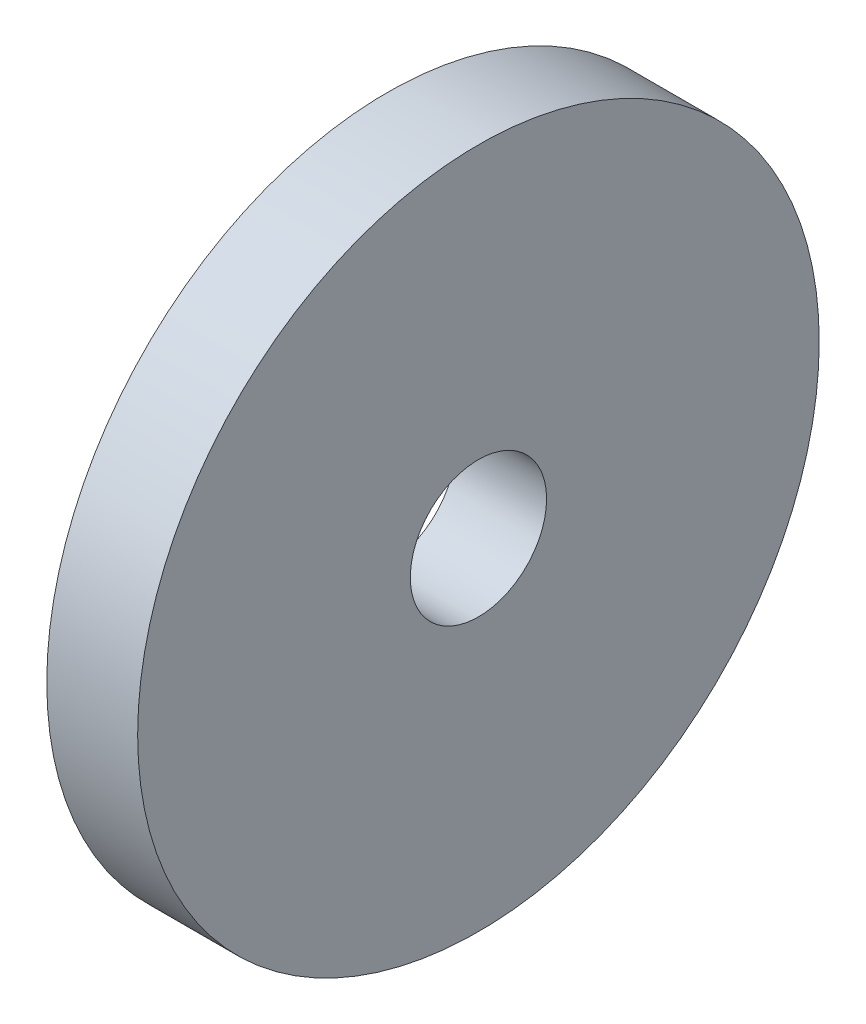
ISO-10303-21;
HEADER;
FILE_DESCRIPTION(('STEP AP214'),'2;1');
FILE_NAME('part.step','',(''),(''),'','','');
FILE_SCHEMA(('AUTOMOTIVE_DESIGN { 1 0 10303 214 1 1 1 1 }'));
ENDSEC;
DATA;
#1=APPLICATION_CONTEXT('core data for automotive mechanical design processes');
#2=APPLICATION_PROTOCOL_DEFINITION('international standard','automotive_design',2000,#1);
#3=PRODUCT_CONTEXT('',#1,'mechanical');
#4=PRODUCT('Part','Part','',(#3));
#5=PRODUCT_RELATED_PRODUCT_CATEGORY('part','',(#4));
#6=PRODUCT_DEFINITION_FORMATION('','',#4);
#7=PRODUCT_DEFINITION_CONTEXT('part definition',#1,'design');
#8=PRODUCT_DEFINITION('design','',#6,#7);
#9=PRODUCT_DEFINITION_SHAPE('','',#8);
#10=(LENGTH_UNIT() NAMED_UNIT(*) SI_UNIT(.MILLI.,.METRE.));
#11=(NAMED_UNIT(*) PLANE_ANGLE_UNIT() SI_UNIT($,.RADIAN.));
#12=(NAMED_UNIT(*) SI_UNIT($,.STERADIAN.) SOLID_ANGLE_UNIT());
#13=UNCERTAINTY_MEASURE_WITH_UNIT(LENGTH_MEASURE(1.E-05),#10,'distance_accuracy_value','');
#14=(GEOMETRIC_REPRESENTATION_CONTEXT(3) GLOBAL_UNCERTAINTY_ASSIGNED_CONTEXT((#13)) GLOBAL_UNIT_ASSIGNED_CONTEXT((#10,
#11,#12)) REPRESENTATION_CONTEXT('',''));
#15=CARTESIAN_POINT('',(0.,0.,0.));
#16=DIRECTION('',(0.,0.,1.));
#17=DIRECTION('',(1.,0.,0.));
#18=AXIS2_PLACEMENT_3D('',#15,#16,#17);
#19=CARTESIAN_POINT('',(2.,0.,0.));
#20=DIRECTION('',(-1.,0.,0.));
#21=DIRECTION('',(0.,0.,1.));
#22=AXIS2_PLACEMENT_3D('',#19,#20,#21);
#23=CYLINDRICAL_SURFACE('',#22,7.5);
#24=CARTESIAN_POINT('',(2.,0.,0.));
#25=DIRECTION('',(1.,0.,0.));
#26=DIRECTION('',(0.,0.,-1.));
#27=AXIS2_PLACEMENT_3D('',#24,#25,#26);
#28=CIRCLE('',#27,7.5);
#29=CARTESIAN_POINT('',(2.,0.,-7.5));
#30=VERTEX_POINT('',#29);
#31=EDGE_CURVE('E10',#30,#30,#28,.T.);
#32=ORIENTED_EDGE('',*,*,#31,.F.);
#33=EDGE_LOOP('',(#32));
#34=FACE_BOUND('',#33,.T.);
#35=CARTESIAN_POINT('',(0.,0.,0.));
#36=DIRECTION('',(1.,0.,0.));
#37=DIRECTION('',(0.,0.,-1.));
#38=AXIS2_PLACEMENT_3D('',#35,#36,#37);
#39=CIRCLE('',#38,7.5);
#40=CARTESIAN_POINT('',(0.,0.,-7.5));
#41=VERTEX_POINT('',#40);
#42=EDGE_CURVE('E34',#41,#41,#39,.T.);
#43=ORIENTED_EDGE('',*,*,#42,.T.);
#44=EDGE_LOOP('',(#43));
#45=FACE_BOUND('',#44,.T.);
#46=ADVANCED_FACE('F31',(#34,#45),#23,.T.);
#47=CARTESIAN_POINT('',(2.,0.,0.));
#48=DIRECTION('',(1.,0.,0.));
#49=DIRECTION('',(0.,0.,-1.));
#50=AXIS2_PLACEMENT_3D('',#47,#48,#49);
#51=PLANE('',#50);
#52=CARTESIAN_POINT('',(2.,0.,0.));
#53=DIRECTION('',(1.,0.,0.));
#54=DIRECTION('',(0.,0.,-1.));
#55=AXIS2_PLACEMENT_3D('',#52,#53,#54);
#56=CIRCLE('',#55,1.5);
#57=CARTESIAN_POINT('',(2.,0.,-1.5));
#58=VERTEX_POINT('',#57);
#59=EDGE_CURVE('E43',#58,#58,#56,.T.);
#60=ORIENTED_EDGE('',*,*,#59,.F.);
#61=EDGE_LOOP('',(#60));
#62=FACE_BOUND('',#61,.T.);
#63=ORIENTED_EDGE('',*,*,#31,.T.);
#64=EDGE_LOOP('',(#63));
#65=FACE_BOUND('',#64,.T.);
#66=ADVANCED_FACE('F58',(#62,#65),#51,.T.);
#67=CARTESIAN_POINT('',(0.,0.,0.));
#68=DIRECTION('',(1.,0.,0.));
#69=DIRECTION('',(0.,0.,-1.));
#70=AXIS2_PLACEMENT_3D('',#67,#68,#69);
#71=PLANE('',#70);
#72=CARTESIAN_POINT('',(0.,0.,0.));
#73=DIRECTION('',(1.,0.,0.));
#74=DIRECTION('',(0.,0.,-1.));
#75=AXIS2_PLACEMENT_3D('',#72,#73,#74);
#76=CIRCLE('',#75,1.5);
#77=CARTESIAN_POINT('',(0.,0.,-1.5));
#78=VERTEX_POINT('',#77);
#79=EDGE_CURVE('E41',#78,#78,#76,.T.);
#80=ORIENTED_EDGE('',*,*,#79,.T.);
#81=EDGE_LOOP('',(#80));
#82=FACE_BOUND('',#81,.T.);
#83=ORIENTED_EDGE('',*,*,#42,.F.);
#84=EDGE_LOOP('',(#83));
#85=FACE_BOUND('',#84,.T.);
#86=ADVANCED_FACE('F49',(#82,#85),#71,.F.);
#87=CARTESIAN_POINT('',(0.,0.,0.));
#88=DIRECTION('',(1.,0.,0.));
#89=DIRECTION('',(0.,0.,-1.));
#90=AXIS2_PLACEMENT_3D('',#87,#88,#89);
#91=CYLINDRICAL_SURFACE('',#90,1.5);
#92=ORIENTED_EDGE('',*,*,#79,.F.);
#93=EDGE_LOOP('',(#92));
#94=FACE_BOUND('',#93,.T.);
#95=ORIENTED_EDGE('',*,*,#59,.T.);
#96=EDGE_LOOP('',(#95));
#97=FACE_BOUND('',#96,.T.);
#98=ADVANCED_FACE('F52',(#94,#97),#91,.F.);
#99=CLOSED_SHELL('',(#46,#66,#86,#98));
#100=MANIFOLD_SOLID_BREP('B2',#99);
#101=ADVANCED_BREP_SHAPE_REPRESENTATION('',(#18,#100),#14);
#102=SHAPE_DEFINITION_REPRESENTATION(#9,#101);
ENDSEC;
END-ISO-10303-21;
